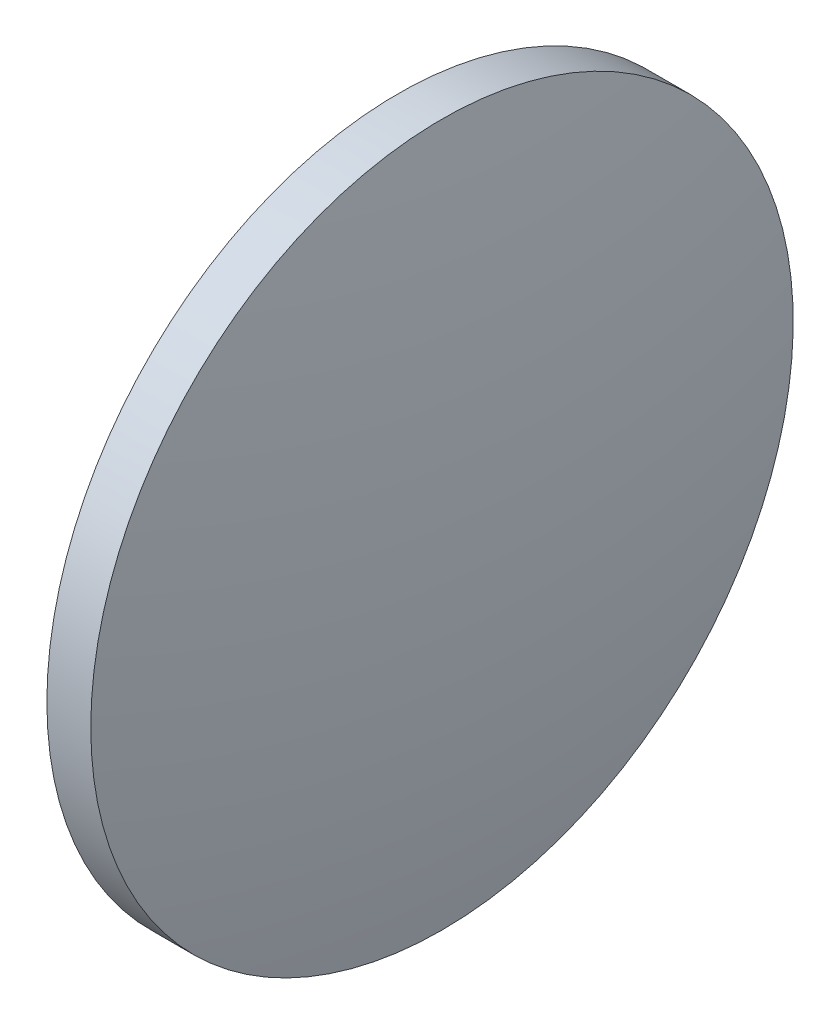
ISO-10303-21;
HEADER;
FILE_DESCRIPTION(('STEP AP214'),'2;1');
FILE_NAME('part.step','',(''),(''),'','','');
FILE_SCHEMA(('AUTOMOTIVE_DESIGN { 1 0 10303 214 1 1 1 1 }'));
ENDSEC;
DATA;
#1=APPLICATION_CONTEXT('core data for automotive mechanical design processes');
#2=APPLICATION_PROTOCOL_DEFINITION('international standard','automotive_design',2000,#1);
#3=PRODUCT_CONTEXT('',#1,'mechanical');
#4=PRODUCT('Part','Part','',(#3));
#5=PRODUCT_RELATED_PRODUCT_CATEGORY('part','',(#4));
#6=PRODUCT_DEFINITION_FORMATION('','',#4);
#7=PRODUCT_DEFINITION_CONTEXT('part definition',#1,'design');
#8=PRODUCT_DEFINITION('design','',#6,#7);
#9=PRODUCT_DEFINITION_SHAPE('','',#8);
#10=(LENGTH_UNIT() NAMED_UNIT(*) SI_UNIT(.MILLI.,.METRE.));
#11=(NAMED_UNIT(*) PLANE_ANGLE_UNIT() SI_UNIT($,.RADIAN.));
#12=(NAMED_UNIT(*) SI_UNIT($,.STERADIAN.) SOLID_ANGLE_UNIT());
#13=UNCERTAINTY_MEASURE_WITH_UNIT(LENGTH_MEASURE(1.E-05),#10,'distance_accuracy_value','');
#14=(GEOMETRIC_REPRESENTATION_CONTEXT(3) GLOBAL_UNCERTAINTY_ASSIGNED_CONTEXT((#13)) GLOBAL_UNIT_ASSIGNED_CONTEXT((#10,
#11,#12)) REPRESENTATION_CONTEXT('',''));
#15=CARTESIAN_POINT('',(0.,0.,0.));
#16=DIRECTION('',(0.,0.,1.));
#17=DIRECTION('',(1.,0.,0.));
#18=AXIS2_PLACEMENT_3D('',#15,#16,#17);
#19=CARTESIAN_POINT('',(759.569794090009,303.935300340736,0.));
#20=DIRECTION('',(-1.,0.,0.));
#21=DIRECTION('',(0.,-1.,0.));
#22=AXIS2_PLACEMENT_3D('',#19,#20,#21);
#23=SPHERICAL_SURFACE('',#22,103.539102564102);
#24=CARTESIAN_POINT('',(861.158896654111,303.935300340736,0.));
#25=DIRECTION('',(-1.,0.,0.));
#26=DIRECTION('',(0.,0.,1.));
#27=AXIS2_PLACEMENT_3D('',#24,#25,#26);
#28=CIRCLE('',#27,20.);
#29=CARTESIAN_POINT('',(861.158896654111,303.935300340736,20.));
#30=VERTEX_POINT('',#29);
#31=EDGE_CURVE('E10',#30,#30,#28,.T.);
#32=ORIENTED_EDGE('',*,*,#31,.F.);
#33=EDGE_LOOP('',(#32));
#34=FACE_BOUND('',#33,.T.);
#35=ADVANCED_FACE('F35',(#34),#23,.T.);
#36=CARTESIAN_POINT('',(849.152399334338,303.935300340736,0.));
#37=DIRECTION('',(-1.,0.,0.));
#38=DIRECTION('',(0.,0.,1.));
#39=AXIS2_PLACEMENT_3D('',#36,#37,#38);
#40=CYLINDRICAL_SURFACE('',#39,20.);
#41=CARTESIAN_POINT('',(858.658896654111,303.935300340736,0.));
#42=DIRECTION('',(-1.,0.,0.));
#43=DIRECTION('',(0.,0.,1.));
#44=AXIS2_PLACEMENT_3D('',#41,#42,#43);
#45=CIRCLE('',#44,20.);
#46=CARTESIAN_POINT('',(858.658896654111,303.935300340736,20.));
#47=VERTEX_POINT('',#46);
#48=EDGE_CURVE('E41',#47,#47,#45,.T.);
#49=ORIENTED_EDGE('',*,*,#48,.F.);
#50=EDGE_LOOP('',(#49));
#51=FACE_BOUND('',#50,.T.);
#52=ORIENTED_EDGE('',*,*,#31,.T.);
#53=EDGE_LOOP('',(#52));
#54=FACE_BOUND('',#53,.T.);
#55=ADVANCED_FACE('F49',(#51,#54),#40,.T.);
#56=CARTESIAN_POINT('',(858.658896654111,303.935300340736,0.));
#57=DIRECTION('',(1.,0.,0.));
#58=DIRECTION('',(0.,0.,-1.));
#59=AXIS2_PLACEMENT_3D('',#56,#57,#58);
#60=PLANE('',#59);
#61=ORIENTED_EDGE('',*,*,#48,.T.);
#62=EDGE_LOOP('',(#61));
#63=FACE_BOUND('',#62,.T.);
#64=ADVANCED_FACE('F47',(#63),#60,.F.);
#65=CLOSED_SHELL('',(#35,#55,#64));
#66=MANIFOLD_SOLID_BREP('B2',#65);
#67=ADVANCED_BREP_SHAPE_REPRESENTATION('',(#18,#66),#14);
#68=SHAPE_DEFINITION_REPRESENTATION(#9,#67);
ENDSEC;
END-ISO-10303-21;
